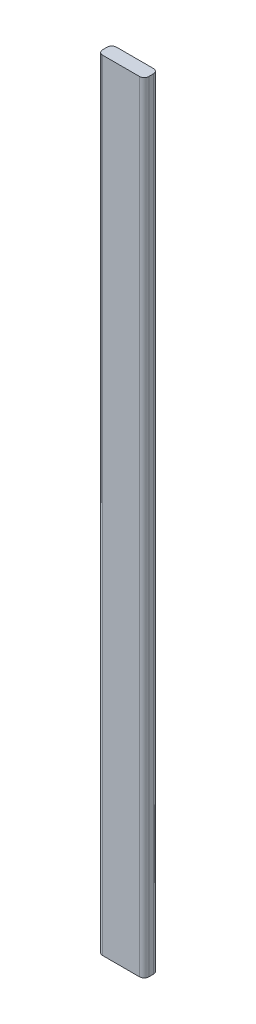
ISO-10303-21;
HEADER;
FILE_DESCRIPTION(('STEP AP214'),'2;1');
FILE_NAME('part.step','',(''),(''),'','','');
FILE_SCHEMA(('AUTOMOTIVE_DESIGN { 1 0 10303 214 1 1 1 1 }'));
ENDSEC;
DATA;
#1=APPLICATION_CONTEXT('core data for automotive mechanical design processes');
#2=APPLICATION_PROTOCOL_DEFINITION('international standard','automotive_design',2000,#1);
#3=PRODUCT_CONTEXT('',#1,'mechanical');
#4=PRODUCT('Part','Part','',(#3));
#5=PRODUCT_RELATED_PRODUCT_CATEGORY('part','',(#4));
#6=PRODUCT_DEFINITION_FORMATION('','',#4);
#7=PRODUCT_DEFINITION_CONTEXT('part definition',#1,'design');
#8=PRODUCT_DEFINITION('design','',#6,#7);
#9=PRODUCT_DEFINITION_SHAPE('','',#8);
#10=(LENGTH_UNIT() NAMED_UNIT(*) SI_UNIT(.MILLI.,.METRE.));
#11=(NAMED_UNIT(*) PLANE_ANGLE_UNIT() SI_UNIT($,.RADIAN.));
#12=(NAMED_UNIT(*) SI_UNIT($,.STERADIAN.) SOLID_ANGLE_UNIT());
#13=UNCERTAINTY_MEASURE_WITH_UNIT(LENGTH_MEASURE(1.E-05),#10,'distance_accuracy_value','');
#14=(GEOMETRIC_REPRESENTATION_CONTEXT(3) GLOBAL_UNCERTAINTY_ASSIGNED_CONTEXT((#13)) GLOBAL_UNIT_ASSIGNED_CONTEXT((#10,
#11,#12)) REPRESENTATION_CONTEXT('',''));
#15=CARTESIAN_POINT('',(0.,0.,0.));
#16=DIRECTION('',(0.,0.,1.));
#17=DIRECTION('',(1.,0.,0.));
#18=AXIS2_PLACEMENT_3D('',#15,#16,#17);
#19=CARTESIAN_POINT('',(-74.,-150.,165.));
#20=DIRECTION('',(0.,1.,0.));
#21=DIRECTION('',(0.,0.,1.));
#22=AXIS2_PLACEMENT_3D('',#19,#20,#21);
#23=CYLINDRICAL_SURFACE('',#22,1.);
#24=CARTESIAN_POINT('',(-73.9999964769584,-150.,165.999999999994));
#25=CARTESIAN_POINT('',(-74.0163589919165,-150.,166.000000404732));
#26=CARTESIAN_POINT('',(-74.0327214787576,-150.,165.999598530609));
#27=CARTESIAN_POINT('',(-74.0654070522256,-150.,165.99799271672));
#28=CARTESIAN_POINT('',(-74.0817301388523,-150.,165.996788776954));
#29=CARTESIAN_POINT('',(-74.1142975679109,-150.,165.993581323852));
#30=CARTESIAN_POINT('',(-74.1305419103428,-150.,165.991577810517));
#31=CARTESIAN_POINT('',(-74.162912722167,-150.,165.986776146352));
#32=CARTESIAN_POINT('',(-74.1790391915594,-150.,165.983977995522));
#33=CARTESIAN_POINT('',(-74.2111354056131,-150.,165.97759376807));
#34=CARTESIAN_POINT('',(-74.2271051502744,-150.,165.974007691449));
#35=CARTESIAN_POINT('',(-74.2588494425654,-150.,165.966056259481));
#36=CARTESIAN_POINT('',(-74.2746239901953,-150.,165.961690904135));
#37=CARTESIAN_POINT('',(-74.3059398858827,-150.,165.952191429184));
#38=CARTESIAN_POINT('',(-74.3214812339403,-150.,165.94705730958));
#39=CARTESIAN_POINT('',(-74.3522932898744,-150.,165.936032675275));
#40=CARTESIAN_POINT('',(-74.3675639977509,-150.,165.930142160574));
#41=CARTESIAN_POINT('',(-74.3977979846775,-150.,165.917618926756));
#42=CARTESIAN_POINT('',(-74.4127612637276,-150.,165.910986207639));
#43=CARTESIAN_POINT('',(-74.4423443449919,-150.,165.8969945439));
#44=CARTESIAN_POINT('',(-74.456964147206,-150.,165.889635599279));
#45=CARTESIAN_POINT('',(-74.4858250542559,-150.,165.874209212944));
#46=CARTESIAN_POINT('',(-74.5000661590915,-150.,165.86614177123));
#47=CARTESIAN_POINT('',(-74.5281353631618,-150.,165.849317825973));
#48=CARTESIAN_POINT('',(-74.5419634623963,-150.,165.84056132243));
#49=CARTESIAN_POINT('',(-74.5691733420126,-150.,165.822380348793));
#50=CARTESIAN_POINT('',(-74.5825551223943,-150.,165.812955878698));
#51=CARTESIAN_POINT('',(-74.6088401262793,-150.,165.793461676434));
#52=CARTESIAN_POINT('',(-74.6217433497826,-150.,165.783391944265));
#53=CARTESIAN_POINT('',(-74.6470401547757,-150.,165.762631476826));
#54=CARTESIAN_POINT('',(-74.6594337362655,-150.,165.751940741557));
#55=CARTESIAN_POINT('',(-74.6836813998744,-150.,165.729964022952));
#56=CARTESIAN_POINT('',(-74.6955354819935,-150.,165.718678039616));
#57=CARTESIAN_POINT('',(-74.7186755892107,-150.,165.695538013922));
#58=CARTESIAN_POINT('',(-74.7299616143089,-150.,165.683683971564));
#59=CARTESIAN_POINT('',(-74.7519384183394,-150.,165.65943638538));
#60=CARTESIAN_POINT('',(-74.7626291972717,-150.,165.647042841554));
#61=CARTESIAN_POINT('',(-74.7833897538321,-150.,165.621746109701));
#62=CARTESIAN_POINT('',(-74.7934595314602,-150.,165.608842921674));
#63=CARTESIAN_POINT('',(-74.8129538263272,-150.,165.582557986468));
#64=CARTESIAN_POINT('',(-74.822378343566,-150.,165.569176239289));
#65=CARTESIAN_POINT('',(-74.8405594130648,-150.,165.541966423726));
#66=CARTESIAN_POINT('',(-74.8493159653248,-150.,165.528138355341));
#67=CARTESIAN_POINT('',(-74.8661400094707,-150.,165.500069210542));
#68=CARTESIAN_POINT('',(-74.8742075013567,-150.,165.485828134128));
#69=CARTESIAN_POINT('',(-74.8896339893699,-150.,165.456967281427));
#70=CARTESIAN_POINT('',(-74.8969929854972,-150.,165.442347505138));
#71=CARTESIAN_POINT('',(-74.9109847534582,-150.,165.412764473167));
#72=CARTESIAN_POINT('',(-74.9176175252918,-150.,165.397801217485));
#73=CARTESIAN_POINT('',(-74.9301408656251,-150.,165.367567274678));
#74=CARTESIAN_POINT('',(-74.9360314341248,-150.,165.352296587554));
#75=CARTESIAN_POINT('',(-74.947056176982,-150.,165.321484570461));
#76=CARTESIAN_POINT('',(-74.9521903513396,-150.,165.305943240491));
#77=CARTESIAN_POINT('',(-74.9616899366175,-150.,165.274627378271));
#78=CARTESIAN_POINT('',(-74.9660553475378,-150.,165.25885284602));
#79=CARTESIAN_POINT('',(-74.9740068913417,-150.,165.227108581743));
#80=CARTESIAN_POINT('',(-74.9775930242253,-150.,165.211138849715));
#81=CARTESIAN_POINT('',(-74.9839773647531,-150.,165.179042658154));
#82=CARTESIAN_POINT('',(-74.9867755723974,-150.,165.16291619862));
#83=CARTESIAN_POINT('',(-74.9915773506062,-150.,165.130545403712));
#84=CARTESIAN_POINT('',(-74.9935809211707,-150.,165.114301068339));
#85=CARTESIAN_POINT('',(-74.9967884890088,-150.,165.08173365058));
#86=CARTESIAN_POINT('',(-74.9979924862823,-150.,165.065410568195));
#87=CARTESIAN_POINT('',(-74.9995984153238,-150.,165.032725000385));
#88=CARTESIAN_POINT('',(-75.0000003470919,-150.,165.01636251496));
#89=CARTESIAN_POINT('',(-75.,-150.,165.));
#90=B_SPLINE_CURVE_WITH_KNOTS('',3,(#24,#25,#26,#27,#28,#29,#30,#31,#32,#33,#34,#35,#36,#37,#38,
#39,#40,#41,#42,#43,#44,#45,#46,#47,#48,#49,#50,#51,#52,#53,#54,#55,#56,#57,#58,#59,#60,#61,#62,
#63,#64,#65,#66,#67,#68,#69,#70,#71,#72,#73,#74,#75,#76,#77,#78,#79,#80,#81,#82,#83,#84,#85,#86,
#87,#88,#89),.UNSPECIFIED.,.F.,.F.,(4,2,2,2,2,2,2,2,2,2,2,2,2,2,2,2,2,2,2,2,2,2,2,2,2,2,2,2,2,2,
2,2,4),(0.,0.0490825671077147,0.0981651342154319,0.14724770132315,0.196330268430858,
0.245412835538566,0.29449540264629,0.343577969754,0.392660536861722,0.441743103969438,
0.490825671077143,0.539908238184848,0.588990805292569,0.638073372400279,0.687155939507997,
0.736238506615713,0.785321073723443,0.834403640831153,0.883486207938862,0.932568775046565,
0.981651342154292,1.03073390926201,1.07981647636972,1.12889904347743,1.17798161058515,
1.22706417769287,1.27614674480059,1.3252293119083,1.37431187901602,1.42339444612371,
1.47247701323143,1.52155958033916,1.57064214744686),.UNSPECIFIED.);
#91=CARTESIAN_POINT('',(-74.,-150.,166.));
#92=VERTEX_POINT('',#91);
#93=CARTESIAN_POINT('',(-75.,-150.,165.));
#94=VERTEX_POINT('',#93);
#95=EDGE_CURVE('E142',#92,#94,#90,.T.);
#96=ORIENTED_EDGE('',*,*,#95,.T.);
#97=DIRECTION('',(0.,-1.,0.));
#98=VECTOR('',#97,1.);
#99=CARTESIAN_POINT('',(-75.,-150.,165.));
#100=LINE('',#99,#98);
#101=CARTESIAN_POINT('',(-75.,-318.5,165.));
#102=VERTEX_POINT('',#101);
#103=EDGE_CURVE('E77',#102,#94,#100,.F.);
#104=ORIENTED_EDGE('',*,*,#103,.F.);
#105=CARTESIAN_POINT('',(-74.,-318.5,165.));
#106=DIRECTION('',(0.,-1.,0.));
#107=DIRECTION('',(0.,0.,-1.));
#108=AXIS2_PLACEMENT_3D('',#105,#106,#107);
#109=CIRCLE('',#108,1.);
#110=CARTESIAN_POINT('',(-74.,-318.5,166.));
#111=VERTEX_POINT('',#110);
#112=EDGE_CURVE('E132',#111,#102,#109,.T.);
#113=ORIENTED_EDGE('',*,*,#112,.F.);
#114=DIRECTION('',(0.,-1.,0.));
#115=VECTOR('',#114,1.);
#116=CARTESIAN_POINT('',(-74.,-318.5,166.));
#117=LINE('',#116,#115);
#118=EDGE_CURVE('E307',#92,#111,#117,.T.);
#119=ORIENTED_EDGE('',*,*,#118,.F.);
#120=EDGE_LOOP('',(#96,#104,#113,#119));
#121=FACE_BOUND('',#120,.T.);
#122=ADVANCED_FACE('F65',(#121),#23,.T.);
#123=CARTESIAN_POINT('',(-64.9993921985842,-149.44872843489,164.005774577235));
#124=CARTESIAN_POINT('',(-64.9993733848164,-149.440196096235,163.005792163333));
#125=CARTESIAN_POINT('',(-65.9993897681992,-149.437991129018,163.005810977282));
#126=CARTESIAN_POINT('',(-64.9995856453815,-149.53645565822,164.005023048149));
#127=CARTESIAN_POINT('',(-64.9995685859467,-149.527360494602,163.005047189454));
#128=CARTESIAN_POINT('',(-65.9995839902875,-149.525506518801,163.005064249815));
#129=CARTESIAN_POINT('',(-64.9997329138605,-149.624182368897,164.004197166913));
#130=CARTESIAN_POINT('',(-64.9997182000707,-149.614524428427,163.004228931287));
#131=CARTESIAN_POINT('',(-65.9997318476992,-149.613021408633,163.004243645141));
#132=CARTESIAN_POINT('',(-64.999935093455,-149.799629663267,164.002396758414));
#133=CARTESIAN_POINT('',(-64.9999262544911,-149.788846361538,163.002445901181));
#134=CARTESIAN_POINT('',(-65.9999348349136,-149.788045099134,163.002454739208));
#135=CARTESIAN_POINT('',(-64.9999900095387,-149.887350247035,164.00142223915));
#136=CARTESIAN_POINT('',(-64.9999846998367,-149.87600425763,163.001481138614));
#137=CARTESIAN_POINT('',(-65.9999899697047,-149.875553899878,163.001486445899));
#138=CARTESIAN_POINT('',(-64.9999999877873,-149.987412476973,164.000225807326));
#139=CARTESIAN_POINT('',(-64.9999993802837,-149.975424902869,163.000297050209));
#140=CARTESIAN_POINT('',(-65.9999999877205,-149.975374563659,163.000297657609));
#141=CARTESIAN_POINT('',(-65.0000003045574,-149.999754999992,164.000076757429));
#142=CARTESIAN_POINT('',(-65.0000002888024,-149.987688266123,163.00014954424));
#143=CARTESIAN_POINT('',(-66.0000003057562,-149.987687290091,163.000149559932));
#144=CARTESIAN_POINT('',(-64.9999997073007,-150.012097504769,163.999926235897));
#145=CARTESIAN_POINT('',(-65.0000002950394,-149.999951615702,163.000000587712));
#146=CARTESIAN_POINT('',(-65.9999997061288,-149.999999998554,163.000000000018));
#147=CARTESIAN_POINT('',(-64.9999960573321,-150.087525322894,163.999006365038));
#148=CARTESIAN_POINT('',(-65.00000031003,-150.075379340485,162.999084382811));
#149=CARTESIAN_POINT('',(-65.9999960415608,-150.075729527947,162.999080129157));
#150=CARTESIAN_POINT('',(-64.9999582712677,-150.162953107209,163.998086494591));
#151=CARTESIAN_POINT('',(-64.9999661884093,-150.150807172977,162.998168176601));
#152=CARTESIAN_POINT('',(-65.9999581043525,-150.151459023396,162.99816025871));
#153=CARTESIAN_POINT('',(-64.9998026406518,-150.326169384999,163.996096010158));
#154=CARTESIAN_POINT('',(-64.9998184867992,-150.314023513185,162.996185621627));
#155=CARTESIAN_POINT('',(-65.9998018512146,-150.315328166293,162.996169774276));
#156=CARTESIAN_POINT('',(-64.9996726912124,-150.413957866485,163.995025396319));
#157=CARTESIAN_POINT('',(-64.9996928021725,-150.401812059098,162.995119272399));
#158=CARTESIAN_POINT('',(-65.9996713819775,-150.403467801706,162.995099160437));
#159=CARTESIAN_POINT('',(-64.9994965007895,-150.501746302172,163.993954783037));
#160=CARTESIAN_POINT('',(-64.9995208767803,-150.489600750919,162.994052921397));
#161=CARTESIAN_POINT('',(-65.9994944867927,-150.491607391137,162.994028547156));
#162=(BOUNDED_SURFACE() B_SPLINE_SURFACE(3,2,((#123,#124,#125),(#126,#127,#128),(#129,#130,
#131),(#132,#133,#134),(#135,#136,#137),(#138,#139,#140),(#141,#142,#143),(#144,#145,#146),
(#147,#148,#149),(#150,#151,#152),(#153,#154,#155),(#156,#157,#158),(#159,#160,#161)),
.UNSPECIFIED.,.F.,.F.,.F.) B_SPLINE_SURFACE_WITH_KNOTS((4,2,2,3,2,4),(3,3),(0.,
0.264244648918002,0.528475081449159,0.565653449324628,0.792858723780093,1.05729742575346),(0.,
1.),.UNSPECIFIED.) GEOMETRIC_REPRESENTATION_ITEM() RATIONAL_B_SPLINE_SURFACE(((1.,
0.707100129302692,1.),(1.,0.707100749134043,1.),(1.,0.707101578425198,1.),(1.,0.707103655812639,
1.),(1.,0.707104903886391,1.),(1.,0.707106566408704,1.),(1.,0.707106775623801,1.),(1.,
0.707106988984035,1.),(1.,0.707108284599083,1.),(1.,0.707109580209987,1.),(1.,0.707112383741997,
1.),(1.,0.707113891661633,1.),(1.,0.707115399575656,1.))) REPRESENTATION_ITEM('') SURFACE());
#163=CARTESIAN_POINT('',(-65.,-150.,164.000073298226));
#164=CARTESIAN_POINT('',(-65.000000188242,-150.,163.971934980557));
#165=CARTESIAN_POINT('',(-65.001188218595,-150.,163.943810142859));
#166=CARTESIAN_POINT('',(-65.0059277620821,-150.,163.887761713186));
#167=CARTESIAN_POINT('',(-65.009479162183,-150.,163.859838111652));
#168=CARTESIAN_POINT('',(-65.0236447162974,-150.,163.776717888824));
#169=CARTESIAN_POINT('',(-65.0377703175036,-150.,163.722078023967));
#170=CARTESIAN_POINT('',(-65.0749938588537,-150.,163.615946847099));
#171=CARTESIAN_POINT('',(-65.0980961124502,-150.,163.564457062549));
#172=CARTESIAN_POINT('',(-65.1526149670592,-150.,163.466088531329));
#173=CARTESIAN_POINT('',(-65.1840300983261,-150.,163.419208971562));
#174=CARTESIAN_POINT('',(-65.254282447319,-150.,163.331393178276));
#175=CARTESIAN_POINT('',(-65.2931193529255,-150.,163.290456694952));
#176=CARTESIAN_POINT('',(-65.3771242388105,-150.,163.215676711107));
#177=CARTESIAN_POINT('',(-65.4222934552116,-150.,163.181834598695));
#178=CARTESIAN_POINT('',(-65.5176739849195,-150.,163.122212610257));
#179=CARTESIAN_POINT('',(-65.5678859333032,-150.,163.096433751396));
#180=CARTESIAN_POINT('',(-65.6719153746449,-150.,163.053685774425));
#181=CARTESIAN_POINT('',(-65.7257307308273,-150.,163.036711486645));
#182=CARTESIAN_POINT('',(-65.8165631265881,-150.,163.016275582882));
#183=CARTESIAN_POINT('',(-65.853008500782,-150.,163.010175927648));
#184=CARTESIAN_POINT('',(-65.9262973892044,-150.,163.002038675928));
#185=CARTESIAN_POINT('',(-65.9631402642946,-150.,162.99999532127));
#186=CARTESIAN_POINT('',(-65.99999970614,-150.,163.));
#187=B_SPLINE_CURVE_WITH_KNOTS('',3,(#163,#164,#165,#166,#167,#168,#169,#170,#171,#172,#173,
#174,#175,#176,#177,#178,#179,#180,#181,#182,#183,#184,#185,#186),.UNSPECIFIED.,.F.,.F.,(4,2,2,
2,2,2,2,2,2,2,2,4),(0.,0.0843631047393335,0.168722174920406,0.33716242176038,0.505683707644712,
0.674175218266604,0.842659644613122,1.01117700651744,1.17971561801691,1.34815515847775,
1.45880181488676,1.56929128885982),.UNSPECIFIED.);
#188=CARTESIAN_POINT('',(-65.,-150.,164.000073298226));
#189=VERTEX_POINT('',#188);
#190=CARTESIAN_POINT('',(-65.99999970614,-150.,163.));
#191=VERTEX_POINT('',#190);
#192=EDGE_CURVE('E248',#189,#191,#187,.T.);
#193=ORIENTED_EDGE('',*,*,#192,.F.);
#194=CARTESIAN_POINT('',(-65.,-150.006048241429,164.));
#195=CARTESIAN_POINT('',(-65.,-150.,164.000073298226));
#196=B_SPLINE_CURVE_WITH_KNOTS('',1,(#194,#195),.UNSPECIFIED.,.F.,.F.,(2,2),(0.,1.),.UNSPECIFIED.);
#197=CARTESIAN_POINT('',(-65.,-150.006048241429,164.));
#198=VERTEX_POINT('',#197);
#199=EDGE_CURVE('E264',#198,#189,#196,.T.);
#200=ORIENTED_EDGE('',*,*,#199,.F.);
#201=CARTESIAN_POINT('',(-65.9999998530649,-150.000000000001,163.));
#202=CARTESIAN_POINT('',(-65.9718666182722,-149.999999320001,163.000000192033));
#203=CARTESIAN_POINT('',(-65.9437468625654,-150.000005853472,163.001187971829));
#204=CARTESIAN_POINT('',(-65.8877085541683,-150.000033275471,163.005926501259));
#205=CARTESIAN_POINT('',(-65.8597899919153,-150.000054163313,163.009477137827));
#206=CARTESIAN_POINT('',(-65.7766804257568,-150.000138163557,163.023640364766));
#207=CARTESIAN_POINT('',(-65.7220461679598,-150.000222611062,163.037764360804));
#208=CARTESIAN_POINT('',(-65.6159258757042,-150.00044603885,163.07498393631));
#209=CARTESIAN_POINT('',(-65.5644413789011,-150.000585045526,163.098083857842));
#210=CARTESIAN_POINT('',(-65.4660873930218,-150.000913511619,163.152594691082));
#211=CARTESIAN_POINT('',(-65.4192166856569,-150.001102957667,163.184003400701));
#212=CARTESIAN_POINT('',(-65.3314186903329,-150.001526960834,163.25423860392));
#213=CARTESIAN_POINT('',(-65.290490881097,-150.001761513991,163.293064446239));
#214=CARTESIAN_POINT('',(-65.2157148476812,-150.002268446196,163.377056358111));
#215=CARTESIAN_POINT('',(-65.1818698663266,-150.002540842476,163.422225316071));
#216=CARTESIAN_POINT('',(-65.1222314010013,-150.003117504319,163.517620218084));
#217=CARTESIAN_POINT('',(-65.0964419298502,-150.003421785665,163.567848666078));
#218=CARTESIAN_POINT('',(-65.0536955806508,-150.0040439889,163.671882440573));
#219=CARTESIAN_POINT('',(-65.0367262511028,-150.004361890871,163.725682603092));
#220=CARTESIAN_POINT('',(-65.0184988957185,-150.00485324778,163.806661296854));
#221=CARTESIAN_POINT('',(-65.0136630615523,-150.005015516313,163.833082222901));
#222=CARTESIAN_POINT('',(-65.0061345368934,-150.005302054018,163.886207155493));
#223=CARTESIAN_POINT('',(-65.0034395824696,-150.005426363245,163.912910832663));
#224=CARTESIAN_POINT('',(-65.0005664101557,-150.005715219593,163.960426548313));
#225=CARTESIAN_POINT('',(-64.9999586180885,-150.005864439159,163.981213549058));
#226=CARTESIAN_POINT('',(-65.0000019536796,-150.00606342886,164.001995143258));
#227=B_SPLINE_CURVE_WITH_KNOTS('',3,(#201,#202,#203,#204,#205,#206,#207,#208,#209,#210,#211,
#212,#213,#214,#215,#216,#217,#218,#219,#220,#221,#222,#223,#224,#225,#226),.UNSPECIFIED.,.F.,
.F.,(4,2,2,2,2,2,2,2,2,2,2,2,4),(0.,0.0843478634729746,0.168691691102782,0.337114635523879,
0.505619155413965,0.674079061006871,0.842524181330666,1.01104625520846,1.17965214427976,
1.34801935945599,1.42853073559687,1.50895685905577,1.57130310159503),.UNSPECIFIED.);
#228=EDGE_CURVE('E258',#198,#191,#227,.F.);
#229=ORIENTED_EDGE('',*,*,#228,.T.);
#230=EDGE_LOOP('',(#193,#200,#229));
#231=FACE_BOUND('',#230,.T.);
#232=ADVANCED_FACE('F181',(#231),#162,.T.);
#233=CARTESIAN_POINT('',(-66.,-150.,164.));
#234=DIRECTION('',(0.,-1.,0.));
#235=DIRECTION('',(0.,0.,-1.));
#236=AXIS2_PLACEMENT_3D('',#233,#234,#235);
#237=CYLINDRICAL_SURFACE('',#236,1.);
#238=CARTESIAN_POINT('',(-66.,-318.5,164.));
#239=DIRECTION('',(0.,1.,0.));
#240=DIRECTION('',(0.,0.,1.));
#241=AXIS2_PLACEMENT_3D('',#238,#239,#240);
#242=CIRCLE('',#241,1.);
#243=CARTESIAN_POINT('',(-65.,-318.5,164.));
#244=VERTEX_POINT('',#243);
#245=CARTESIAN_POINT('',(-66.,-318.5,163.));
#246=VERTEX_POINT('',#245);
#247=EDGE_CURVE('E175',#244,#246,#242,.T.);
#248=ORIENTED_EDGE('',*,*,#247,.T.);
#249=DIRECTION('',(0.,-1.,0.));
#250=VECTOR('',#249,1.);
#251=CARTESIAN_POINT('',(-66.,-150.,163.));
#252=LINE('',#251,#250);
#253=EDGE_CURVE('E157',#191,#246,#252,.T.);
#254=ORIENTED_EDGE('',*,*,#253,.F.);
#255=ORIENTED_EDGE('',*,*,#228,.F.);
#256=DIRECTION('',(0.,-1.,0.));
#257=VECTOR('',#256,1.);
#258=CARTESIAN_POINT('',(-65.,-428.508297590561,164.));
#259=LINE('',#258,#257);
#260=EDGE_CURVE('E240',#244,#198,#259,.F.);
#261=ORIENTED_EDGE('',*,*,#260,.F.);
#262=EDGE_LOOP('',(#248,#254,#255,#261));
#263=FACE_BOUND('',#262,.T.);
#264=ADVANCED_FACE('F202',(#263),#237,.T.);
#265=CARTESIAN_POINT('',(-66.,-150.,165.));
#266=DIRECTION('',(0.,1.,0.));
#267=DIRECTION('',(0.,0.,1.));
#268=AXIS2_PLACEMENT_3D('',#265,#266,#267);
#269=CYLINDRICAL_SURFACE('',#268,1.);
#270=CARTESIAN_POINT('',(-66.,-150.,165.));
#271=DIRECTION('',(0.,1.,0.));
#272=DIRECTION('',(0.,0.,1.));
#273=AXIS2_PLACEMENT_3D('',#270,#271,#272);
#274=CIRCLE('',#273,1.);
#275=CARTESIAN_POINT('',(-65.,-150.,165.));
#276=VERTEX_POINT('',#275);
#277=CARTESIAN_POINT('',(-66.,-150.,166.));
#278=VERTEX_POINT('',#277);
#279=EDGE_CURVE('E143',#276,#278,#274,.F.);
#280=ORIENTED_EDGE('',*,*,#279,.T.);
#281=DIRECTION('',(0.,1.,0.));
#282=VECTOR('',#281,1.);
#283=CARTESIAN_POINT('',(-66.,-150.,166.));
#284=LINE('',#283,#282);
#285=CARTESIAN_POINT('',(-66.,-318.5,166.));
#286=VERTEX_POINT('',#285);
#287=EDGE_CURVE('E260',#286,#278,#284,.T.);
#288=ORIENTED_EDGE('',*,*,#287,.F.);
#289=CARTESIAN_POINT('',(-66.,-318.5,165.));
#290=DIRECTION('',(0.,-1.,0.));
#291=DIRECTION('',(0.,0.,-1.));
#292=AXIS2_PLACEMENT_3D('',#289,#290,#291);
#293=CIRCLE('',#292,1.);
#294=CARTESIAN_POINT('',(-65.,-318.5,165.));
#295=VERTEX_POINT('',#294);
#296=EDGE_CURVE('E166',#295,#286,#293,.T.);
#297=ORIENTED_EDGE('',*,*,#296,.F.);
#298=DIRECTION('',(0.,1.,0.));
#299=VECTOR('',#298,1.);
#300=CARTESIAN_POINT('',(-65.,-428.508297590561,165.));
#301=LINE('',#300,#299);
#302=EDGE_CURVE('E287',#276,#295,#301,.F.);
#303=ORIENTED_EDGE('',*,*,#302,.F.);
#304=EDGE_LOOP('',(#280,#288,#297,#303));
#305=FACE_BOUND('',#304,.T.);
#306=ADVANCED_FACE('F192',(#305),#269,.T.);
#307=CARTESIAN_POINT('',(-65.,-428.508297590561,-1.2E-05));
#308=DIRECTION('',(-1.,0.,0.));
#309=DIRECTION('',(0.,-1.,0.));
#310=AXIS2_PLACEMENT_3D('',#307,#308,#309);
#311=PLANE('',#310);
#312=ORIENTED_EDGE('',*,*,#302,.T.);
#313=DIRECTION('',(0.,0.,-1.));
#314=VECTOR('',#313,1.);
#315=CARTESIAN_POINT('',(-65.,-318.5,-1.2E-05));
#316=LINE('',#315,#314);
#317=EDGE_CURVE('E152',#295,#244,#316,.T.);
#318=ORIENTED_EDGE('',*,*,#317,.T.);
#319=ORIENTED_EDGE('',*,*,#260,.T.);
#320=ORIENTED_EDGE('',*,*,#199,.T.);
#321=DIRECTION('',(0.,0.,-1.));
#322=VECTOR('',#321,1.);
#323=CARTESIAN_POINT('',(-65.,-150.,276.));
#324=LINE('',#323,#322);
#325=EDGE_CURVE('E272',#276,#189,#324,.T.);
#326=ORIENTED_EDGE('',*,*,#325,.F.);
#327=EDGE_LOOP('',(#312,#318,#319,#320,#326));
#328=FACE_BOUND('',#327,.T.);
#329=ADVANCED_FACE('F201',(#328),#311,.F.);
#330=CARTESIAN_POINT('',(75.,-150.,166.));
#331=DIRECTION('',(0.,0.,-1.));
#332=DIRECTION('',(0.,1.,0.));
#333=AXIS2_PLACEMENT_3D('',#330,#331,#332);
#334=PLANE('',#333);
#335=DIRECTION('',(-1.,0.,0.));
#336=VECTOR('',#335,1.);
#337=CARTESIAN_POINT('',(75.,-318.5,166.));
#338=LINE('',#337,#336);
#339=EDGE_CURVE('E137',#286,#111,#338,.T.);
#340=ORIENTED_EDGE('',*,*,#339,.F.);
#341=ORIENTED_EDGE('',*,*,#287,.T.);
#342=DIRECTION('',(1.,0.,0.));
#343=VECTOR('',#342,1.);
#344=CARTESIAN_POINT('',(-75.,-150.,166.));
#345=LINE('',#344,#343);
#346=EDGE_CURVE('E85',#92,#278,#345,.T.);
#347=ORIENTED_EDGE('',*,*,#346,.F.);
#348=ORIENTED_EDGE('',*,*,#118,.T.);
#349=EDGE_LOOP('',(#340,#341,#347,#348));
#350=FACE_BOUND('',#349,.T.);
#351=ADVANCED_FACE('F297',(#350),#334,.F.);
#352=CARTESIAN_POINT('',(-74.,-150.,164.));
#353=DIRECTION('',(0.,-1.,0.));
#354=DIRECTION('',(0.,0.,-1.));
#355=AXIS2_PLACEMENT_3D('',#352,#353,#354);
#356=CYLINDRICAL_SURFACE('',#355,1.);
#357=CARTESIAN_POINT('',(-74.,-150.,164.));
#358=DIRECTION('',(0.,-1.,0.));
#359=DIRECTION('',(0.,0.,-1.));
#360=AXIS2_PLACEMENT_3D('',#357,#358,#359);
#361=CIRCLE('',#360,1.);
#362=CARTESIAN_POINT('',(-74.0000315575058,-149.99999999999,163.));
#363=VERTEX_POINT('',#362);
#364=CARTESIAN_POINT('',(-75.,-150.,163.999991111113));
#365=VERTEX_POINT('',#364);
#366=EDGE_CURVE('E70',#363,#365,#361,.F.);
#367=ORIENTED_EDGE('',*,*,#366,.F.);
#368=DIRECTION('',(0.,1.,0.));
#369=VECTOR('',#368,1.);
#370=CARTESIAN_POINT('',(-74.,-150.,163.));
#371=LINE('',#370,#369);
#372=CARTESIAN_POINT('',(-74.,-318.5,163.));
#373=VERTEX_POINT('',#372);
#374=EDGE_CURVE('E154',#373,#363,#371,.T.);
#375=ORIENTED_EDGE('',*,*,#374,.F.);
#376=CARTESIAN_POINT('',(-74.,-318.5,164.));
#377=DIRECTION('',(0.,-1.,0.));
#378=DIRECTION('',(0.,0.,-1.));
#379=AXIS2_PLACEMENT_3D('',#376,#377,#378);
#380=CIRCLE('',#379,1.);
#381=CARTESIAN_POINT('',(-75.,-318.5,164.));
#382=VERTEX_POINT('',#381);
#383=EDGE_CURVE('E266',#382,#373,#380,.T.);
#384=ORIENTED_EDGE('',*,*,#383,.F.);
#385=DIRECTION('',(0.,1.,0.));
#386=VECTOR('',#385,1.);
#387=CARTESIAN_POINT('',(-75.,-318.5,164.));
#388=LINE('',#387,#386);
#389=EDGE_CURVE('E13',#365,#382,#388,.F.);
#390=ORIENTED_EDGE('',*,*,#389,.F.);
#391=EDGE_LOOP('',(#367,#375,#384,#390));
#392=FACE_BOUND('',#391,.T.);
#393=ADVANCED_FACE('F67',(#392),#356,.T.);
#394=CARTESIAN_POINT('',(75.,-150.,163.));
#395=DIRECTION('',(0.,0.,1.));
#396=DIRECTION('',(0.,-1.,0.));
#397=AXIS2_PLACEMENT_3D('',#394,#395,#396);
#398=PLANE('',#397);
#399=DIRECTION('',(-1.,0.,0.));
#400=VECTOR('',#399,1.);
#401=CARTESIAN_POINT('',(75.,-318.5,163.));
#402=LINE('',#401,#400);
#403=EDGE_CURVE('E273',#246,#373,#402,.T.);
#404=ORIENTED_EDGE('',*,*,#403,.T.);
#405=ORIENTED_EDGE('',*,*,#374,.T.);
#406=DIRECTION('',(-1.,0.,0.));
#407=VECTOR('',#406,1.);
#408=CARTESIAN_POINT('',(-75.,-150.,163.));
#409=LINE('',#408,#407);
#410=EDGE_CURVE('E236',#191,#363,#409,.T.);
#411=ORIENTED_EDGE('',*,*,#410,.F.);
#412=ORIENTED_EDGE('',*,*,#253,.T.);
#413=EDGE_LOOP('',(#404,#405,#411,#412));
#414=FACE_BOUND('',#413,.T.);
#415=ADVANCED_FACE('F190',(#414),#398,.F.);
#416=CARTESIAN_POINT('',(-75.,0.,0.));
#417=DIRECTION('',(-1.,0.,0.));
#418=DIRECTION('',(0.,0.,1.));
#419=AXIS2_PLACEMENT_3D('',#416,#417,#418);
#420=PLANE('',#419);
#421=DIRECTION('',(0.,0.,-1.));
#422=VECTOR('',#421,1.);
#423=CARTESIAN_POINT('',(-75.,-318.5,-292.247568964683));
#424=LINE('',#423,#422);
#425=EDGE_CURVE('E135',#102,#382,#424,.T.);
#426=ORIENTED_EDGE('',*,*,#425,.F.);
#427=ORIENTED_EDGE('',*,*,#103,.T.);
#428=DIRECTION('',(0.,0.,1.));
#429=VECTOR('',#428,1.);
#430=CARTESIAN_POINT('',(-75.,-150.,166.));
#431=LINE('',#430,#429);
#432=EDGE_CURVE('E234',#365,#94,#431,.T.);
#433=ORIENTED_EDGE('',*,*,#432,.F.);
#434=ORIENTED_EDGE('',*,*,#389,.T.);
#435=EDGE_LOOP('',(#426,#427,#433,#434));
#436=FACE_BOUND('',#435,.T.);
#437=ADVANCED_FACE('F147',(#436),#420,.T.);
#438=CARTESIAN_POINT('',(78.2659982081033,-318.5,-292.247568964683));
#439=DIRECTION('',(0.,1.,0.));
#440=DIRECTION('',(0.,0.,1.));
#441=AXIS2_PLACEMENT_3D('',#438,#439,#440);
#442=PLANE('',#441);
#443=ORIENTED_EDGE('',*,*,#403,.F.);
#444=ORIENTED_EDGE('',*,*,#247,.F.);
#445=ORIENTED_EDGE('',*,*,#317,.F.);
#446=ORIENTED_EDGE('',*,*,#296,.T.);
#447=ORIENTED_EDGE('',*,*,#339,.T.);
#448=ORIENTED_EDGE('',*,*,#112,.T.);
#449=ORIENTED_EDGE('',*,*,#425,.T.);
#450=ORIENTED_EDGE('',*,*,#383,.T.);
#451=EDGE_LOOP('',(#443,#444,#445,#446,#447,#448,#449,#450));
#452=FACE_BOUND('',#451,.T.);
#453=ADVANCED_FACE('F134',(#452),#442,.F.);
#454=CARTESIAN_POINT('',(78.2659982081033,-150.,525.735213507851));
#455=DIRECTION('',(0.,-1.,0.));
#456=DIRECTION('',(0.,0.,-1.));
#457=AXIS2_PLACEMENT_3D('',#454,#455,#456);
#458=PLANE('',#457);
#459=ORIENTED_EDGE('',*,*,#366,.T.);
#460=ORIENTED_EDGE('',*,*,#432,.T.);
#461=ORIENTED_EDGE('',*,*,#95,.F.);
#462=ORIENTED_EDGE('',*,*,#346,.T.);
#463=ORIENTED_EDGE('',*,*,#279,.F.);
#464=ORIENTED_EDGE('',*,*,#325,.T.);
#465=ORIENTED_EDGE('',*,*,#192,.T.);
#466=ORIENTED_EDGE('',*,*,#410,.T.);
#467=EDGE_LOOP('',(#459,#460,#461,#462,#463,#464,#465,#466));
#468=FACE_BOUND('',#467,.T.);
#469=ADVANCED_FACE('F245',(#468),#458,.F.);
#470=CLOSED_SHELL('',(#122,#232,#264,#306,#329,#351,#393,#415,#437,#453,#469));
#471=MANIFOLD_SOLID_BREP('B2',#470);
#472=ADVANCED_BREP_SHAPE_REPRESENTATION('',(#18,#471),#14);
#473=SHAPE_DEFINITION_REPRESENTATION(#9,#472);
ENDSEC;
END-ISO-10303-21;
